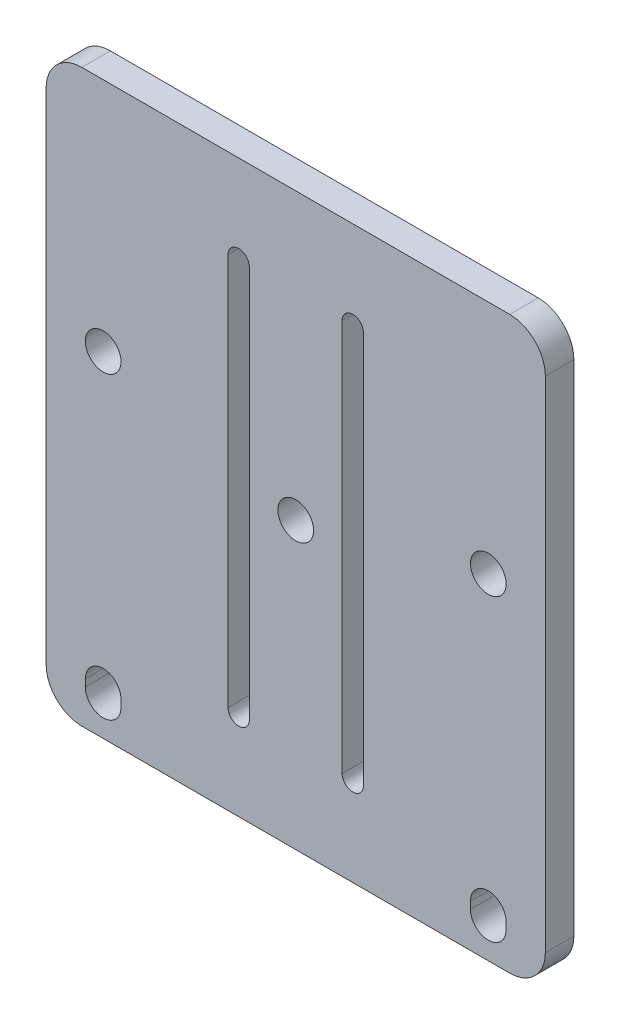
ISO-10303-21;
HEADER;
FILE_DESCRIPTION(('STEP AP214'),'2;1');
FILE_NAME('part.step','',(''),(''),'','','');
FILE_SCHEMA(('AUTOMOTIVE_DESIGN { 1 0 10303 214 1 1 1 1 }'));
ENDSEC;
DATA;
#1=APPLICATION_CONTEXT('core data for automotive mechanical design processes');
#2=APPLICATION_PROTOCOL_DEFINITION('international standard','automotive_design',2000,#1);
#3=PRODUCT_CONTEXT('',#1,'mechanical');
#4=PRODUCT('Part','Part','',(#3));
#5=PRODUCT_RELATED_PRODUCT_CATEGORY('part','',(#4));
#6=PRODUCT_DEFINITION_FORMATION('','',#4);
#7=PRODUCT_DEFINITION_CONTEXT('part definition',#1,'design');
#8=PRODUCT_DEFINITION('design','',#6,#7);
#9=PRODUCT_DEFINITION_SHAPE('','',#8);
#10=(LENGTH_UNIT() NAMED_UNIT(*) SI_UNIT(.MILLI.,.METRE.));
#11=(NAMED_UNIT(*) PLANE_ANGLE_UNIT() SI_UNIT($,.RADIAN.));
#12=(NAMED_UNIT(*) SI_UNIT($,.STERADIAN.) SOLID_ANGLE_UNIT());
#13=UNCERTAINTY_MEASURE_WITH_UNIT(LENGTH_MEASURE(1.E-05),#10,'distance_accuracy_value','');
#14=(GEOMETRIC_REPRESENTATION_CONTEXT(3) GLOBAL_UNCERTAINTY_ASSIGNED_CONTEXT((#13)) GLOBAL_UNIT_ASSIGNED_CONTEXT((#10,
#11,#12)) REPRESENTATION_CONTEXT('',''));
#15=CARTESIAN_POINT('',(0.,0.,0.));
#16=DIRECTION('',(0.,0.,1.));
#17=DIRECTION('',(1.,0.,0.));
#18=AXIS2_PLACEMENT_3D('',#15,#16,#17);
#19=CARTESIAN_POINT('',(0.,0.,4.));
#20=DIRECTION('',(0.,0.,1.));
#21=DIRECTION('',(1.,0.,0.));
#22=AXIS2_PLACEMENT_3D('',#19,#20,#21);
#23=PLANE('',#22);
#24=CARTESIAN_POINT('',(-8.,27.5,4.));
#25=DIRECTION('',(0.,0.,1.));
#26=DIRECTION('',(1.,0.,0.));
#27=AXIS2_PLACEMENT_3D('',#24,#25,#26);
#28=CIRCLE('',#27,1.50000000000001);
#29=CARTESIAN_POINT('',(-6.5,27.5,4.));
#30=VERTEX_POINT('',#29);
#31=CARTESIAN_POINT('',(-9.50000000000001,27.5,4.));
#32=VERTEX_POINT('',#31);
#33=EDGE_CURVE('E60',#30,#32,#28,.T.);
#34=ORIENTED_EDGE('',*,*,#33,.F.);
#35=DIRECTION('',(0.,1.,0.));
#36=VECTOR('',#35,1.);
#37=CARTESIAN_POINT('',(-6.5,27.5,4.));
#38=LINE('',#37,#36);
#39=CARTESIAN_POINT('',(-6.5,-27.5,4.));
#40=VERTEX_POINT('',#39);
#41=EDGE_CURVE('E228',#40,#30,#38,.T.);
#42=ORIENTED_EDGE('',*,*,#41,.F.);
#43=CARTESIAN_POINT('',(-8.,-27.5,4.));
#44=DIRECTION('',(0.,0.,1.));
#45=DIRECTION('',(1.,0.,0.));
#46=AXIS2_PLACEMENT_3D('',#43,#44,#45);
#47=CIRCLE('',#46,1.50000000000001);
#48=CARTESIAN_POINT('',(-9.50000000000001,-27.5,4.));
#49=VERTEX_POINT('',#48);
#50=EDGE_CURVE('E231',#49,#40,#47,.T.);
#51=ORIENTED_EDGE('',*,*,#50,.F.);
#52=DIRECTION('',(0.,-1.,0.));
#53=VECTOR('',#52,1.);
#54=CARTESIAN_POINT('',(-9.50000000000001,27.5,4.));
#55=LINE('',#54,#53);
#56=EDGE_CURVE('E239',#32,#49,#55,.T.);
#57=ORIENTED_EDGE('',*,*,#56,.F.);
#58=EDGE_LOOP('',(#34,#42,#51,#57));
#59=FACE_BOUND('',#58,.T.);
#60=CARTESIAN_POINT('',(7.99999999999999,27.5,4.));
#61=DIRECTION('',(0.,0.,1.));
#62=DIRECTION('',(-1.,0.,0.));
#63=AXIS2_PLACEMENT_3D('',#60,#61,#62);
#64=CIRCLE('',#63,1.50000000000001);
#65=CARTESIAN_POINT('',(9.50000000000002,27.5,4.));
#66=VERTEX_POINT('',#65);
#67=CARTESIAN_POINT('',(6.49999999999999,27.5,4.));
#68=VERTEX_POINT('',#67);
#69=EDGE_CURVE('E68',#66,#68,#64,.T.);
#70=ORIENTED_EDGE('',*,*,#69,.F.);
#71=DIRECTION('',(0.,1.,0.));
#72=VECTOR('',#71,1.);
#73=CARTESIAN_POINT('',(9.50000000000002,27.5,4.));
#74=LINE('',#73,#72);
#75=CARTESIAN_POINT('',(9.50000000000001,-27.5,4.));
#76=VERTEX_POINT('',#75);
#77=EDGE_CURVE('E261',#76,#66,#74,.T.);
#78=ORIENTED_EDGE('',*,*,#77,.F.);
#79=CARTESIAN_POINT('',(7.99999999999999,-27.5,4.));
#80=DIRECTION('',(0.,0.,1.));
#81=DIRECTION('',(-1.,0.,0.));
#82=AXIS2_PLACEMENT_3D('',#79,#80,#81);
#83=CIRCLE('',#82,1.50000000000001);
#84=CARTESIAN_POINT('',(6.49999999999999,-27.5,4.));
#85=VERTEX_POINT('',#84);
#86=EDGE_CURVE('E258',#85,#76,#83,.T.);
#87=ORIENTED_EDGE('',*,*,#86,.F.);
#88=DIRECTION('',(0.,-1.,0.));
#89=VECTOR('',#88,1.);
#90=CARTESIAN_POINT('',(6.49999999999999,27.5,4.));
#91=LINE('',#90,#89);
#92=EDGE_CURVE('E252',#68,#85,#91,.T.);
#93=ORIENTED_EDGE('',*,*,#92,.F.);
#94=EDGE_LOOP('',(#70,#78,#87,#93));
#95=FACE_BOUND('',#94,.T.);
#96=CARTESIAN_POINT('',(0.,0.,4.));
#97=DIRECTION('',(0.,0.,1.));
#98=DIRECTION('',(1.,0.,0.));
#99=AXIS2_PLACEMENT_3D('',#96,#97,#98);
#100=CIRCLE('',#99,2.5);
#101=CARTESIAN_POINT('',(2.5,0.,4.));
#102=VERTEX_POINT('',#101);
#103=EDGE_CURVE('E274',#102,#102,#100,.T.);
#104=ORIENTED_EDGE('',*,*,#103,.F.);
#105=EDGE_LOOP('',(#104));
#106=FACE_BOUND('',#105,.T.);
#107=DIRECTION('',(0.,-1.,0.));
#108=VECTOR('',#107,1.);
#109=CARTESIAN_POINT('',(24.5,-34.,4.));
#110=LINE('',#109,#108);
#111=CARTESIAN_POINT('',(24.5,-34.,4.));
#112=VERTEX_POINT('',#111);
#113=CARTESIAN_POINT('',(24.5,-35.,4.));
#114=VERTEX_POINT('',#113);
#115=EDGE_CURVE('E536',#112,#114,#110,.T.);
#116=ORIENTED_EDGE('',*,*,#115,.F.);
#117=CARTESIAN_POINT('',(27.,-34.,4.));
#118=DIRECTION('',(0.,0.,1.));
#119=DIRECTION('',(-1.,0.,0.));
#120=AXIS2_PLACEMENT_3D('',#117,#118,#119);
#121=CIRCLE('',#120,2.5);
#122=CARTESIAN_POINT('',(29.5,-34.,4.));
#123=VERTEX_POINT('',#122);
#124=EDGE_CURVE('E521',#123,#112,#121,.T.);
#125=ORIENTED_EDGE('',*,*,#124,.F.);
#126=DIRECTION('',(0.,1.,0.));
#127=VECTOR('',#126,1.);
#128=CARTESIAN_POINT('',(29.5,-34.,4.));
#129=LINE('',#128,#127);
#130=CARTESIAN_POINT('',(29.5,-35.,4.));
#131=VERTEX_POINT('',#130);
#132=EDGE_CURVE('E517',#131,#123,#129,.T.);
#133=ORIENTED_EDGE('',*,*,#132,.F.);
#134=CARTESIAN_POINT('',(27.,-35.,4.));
#135=DIRECTION('',(0.,0.,1.));
#136=DIRECTION('',(-1.,0.,0.));
#137=AXIS2_PLACEMENT_3D('',#134,#135,#136);
#138=CIRCLE('',#137,2.5);
#139=EDGE_CURVE('E531',#114,#131,#138,.T.);
#140=ORIENTED_EDGE('',*,*,#139,.F.);
#141=EDGE_LOOP('',(#116,#125,#133,#140));
#142=FACE_BOUND('',#141,.T.);
#143=DIRECTION('',(0.,-1.,0.));
#144=VECTOR('',#143,1.);
#145=CARTESIAN_POINT('',(-29.5,-34.,4.));
#146=LINE('',#145,#144);
#147=CARTESIAN_POINT('',(-29.5,-34.,4.));
#148=VERTEX_POINT('',#147);
#149=CARTESIAN_POINT('',(-29.5,-35.,4.));
#150=VERTEX_POINT('',#149);
#151=EDGE_CURVE('E291',#148,#150,#146,.T.);
#152=ORIENTED_EDGE('',*,*,#151,.F.);
#153=CARTESIAN_POINT('',(-27.,-34.,4.));
#154=DIRECTION('',(0.,0.,1.));
#155=DIRECTION('',(1.,0.,0.));
#156=AXIS2_PLACEMENT_3D('',#153,#154,#155);
#157=CIRCLE('',#156,2.5);
#158=CARTESIAN_POINT('',(-24.5,-34.,4.));
#159=VERTEX_POINT('',#158);
#160=EDGE_CURVE('E308',#159,#148,#157,.T.);
#161=ORIENTED_EDGE('',*,*,#160,.F.);
#162=DIRECTION('',(0.,1.,0.));
#163=VECTOR('',#162,1.);
#164=CARTESIAN_POINT('',(-24.5,-34.,4.));
#165=LINE('',#164,#163);
#166=CARTESIAN_POINT('',(-24.5,-35.,4.));
#167=VERTEX_POINT('',#166);
#168=EDGE_CURVE('E290',#167,#159,#165,.T.);
#169=ORIENTED_EDGE('',*,*,#168,.F.);
#170=CARTESIAN_POINT('',(-27.,-35.,4.));
#171=DIRECTION('',(0.,0.,1.));
#172=DIRECTION('',(1.,0.,0.));
#173=AXIS2_PLACEMENT_3D('',#170,#171,#172);
#174=CIRCLE('',#173,2.5);
#175=EDGE_CURVE('E284',#150,#167,#174,.T.);
#176=ORIENTED_EDGE('',*,*,#175,.F.);
#177=EDGE_LOOP('',(#152,#161,#169,#176));
#178=FACE_BOUND('',#177,.T.);
#179=CARTESIAN_POINT('',(-27.,7.,4.));
#180=DIRECTION('',(0.,0.,1.));
#181=DIRECTION('',(1.,0.,0.));
#182=AXIS2_PLACEMENT_3D('',#179,#180,#181);
#183=CIRCLE('',#182,2.5);
#184=CARTESIAN_POINT('',(-24.5,7.,4.));
#185=VERTEX_POINT('',#184);
#186=EDGE_CURVE('E318',#185,#185,#183,.T.);
#187=ORIENTED_EDGE('',*,*,#186,.F.);
#188=EDGE_LOOP('',(#187));
#189=FACE_BOUND('',#188,.T.);
#190=DIRECTION('',(0.,-1.,0.));
#191=VECTOR('',#190,1.);
#192=CARTESIAN_POINT('',(-35.,40.,4.));
#193=LINE('',#192,#191);
#194=CARTESIAN_POINT('',(-35.,35.,4.));
#195=VERTEX_POINT('',#194);
#196=CARTESIAN_POINT('',(-35.,-35.,4.));
#197=VERTEX_POINT('',#196);
#198=EDGE_CURVE('E333',#195,#197,#193,.T.);
#199=ORIENTED_EDGE('',*,*,#198,.T.);
#200=CARTESIAN_POINT('',(-30.,-35.,4.));
#201=DIRECTION('',(0.,0.,1.));
#202=DIRECTION('',(1.,0.,0.));
#203=AXIS2_PLACEMENT_3D('',#200,#201,#202);
#204=CIRCLE('',#203,5.);
#205=CARTESIAN_POINT('',(-30.,-40.,4.));
#206=VERTEX_POINT('',#205);
#207=EDGE_CURVE('E374',#197,#206,#204,.T.);
#208=ORIENTED_EDGE('',*,*,#207,.T.);
#209=DIRECTION('',(1.,0.,0.));
#210=VECTOR('',#209,1.);
#211=CARTESIAN_POINT('',(-35.,-40.,4.));
#212=LINE('',#211,#210);
#213=CARTESIAN_POINT('',(30.,-40.,4.));
#214=VERTEX_POINT('',#213);
#215=EDGE_CURVE('E337',#206,#214,#212,.T.);
#216=ORIENTED_EDGE('',*,*,#215,.T.);
#217=CARTESIAN_POINT('',(30.,-35.,4.));
#218=DIRECTION('',(0.,0.,1.));
#219=DIRECTION('',(1.,0.,0.));
#220=AXIS2_PLACEMENT_3D('',#217,#218,#219);
#221=CIRCLE('',#220,5.);
#222=CARTESIAN_POINT('',(35.,-35.,4.));
#223=VERTEX_POINT('',#222);
#224=EDGE_CURVE('E372',#214,#223,#221,.T.);
#225=ORIENTED_EDGE('',*,*,#224,.T.);
#226=DIRECTION('',(0.,1.,0.));
#227=VECTOR('',#226,1.);
#228=CARTESIAN_POINT('',(35.,40.,4.));
#229=LINE('',#228,#227);
#230=CARTESIAN_POINT('',(35.,35.,4.));
#231=VERTEX_POINT('',#230);
#232=EDGE_CURVE('E326',#223,#231,#229,.T.);
#233=ORIENTED_EDGE('',*,*,#232,.T.);
#234=CARTESIAN_POINT('',(30.,35.,4.));
#235=DIRECTION('',(0.,0.,1.));
#236=DIRECTION('',(1.,0.,0.));
#237=AXIS2_PLACEMENT_3D('',#234,#235,#236);
#238=CIRCLE('',#237,5.);
#239=CARTESIAN_POINT('',(30.,40.,4.));
#240=VERTEX_POINT('',#239);
#241=EDGE_CURVE('E370',#231,#240,#238,.T.);
#242=ORIENTED_EDGE('',*,*,#241,.T.);
#243=DIRECTION('',(-1.,0.,0.));
#244=VECTOR('',#243,1.);
#245=CARTESIAN_POINT('',(-35.,40.,4.));
#246=LINE('',#245,#244);
#247=CARTESIAN_POINT('',(-30.,40.,4.));
#248=VERTEX_POINT('',#247);
#249=EDGE_CURVE('E329',#240,#248,#246,.T.);
#250=ORIENTED_EDGE('',*,*,#249,.T.);
#251=CARTESIAN_POINT('',(-30.,35.,4.));
#252=DIRECTION('',(0.,0.,1.));
#253=DIRECTION('',(1.,0.,0.));
#254=AXIS2_PLACEMENT_3D('',#251,#252,#253);
#255=CIRCLE('',#254,5.);
#256=EDGE_CURVE('E368',#248,#195,#255,.T.);
#257=ORIENTED_EDGE('',*,*,#256,.T.);
#258=EDGE_LOOP('',(#199,#208,#216,#225,#233,#242,#250,#257));
#259=FACE_BOUND('',#258,.T.);
#260=CARTESIAN_POINT('',(27.,7.,4.));
#261=DIRECTION('',(0.,0.,1.));
#262=DIRECTION('',(-1.,0.,0.));
#263=AXIS2_PLACEMENT_3D('',#260,#261,#262);
#264=CIRCLE('',#263,2.5);
#265=CARTESIAN_POINT('',(24.5,7.,4.));
#266=VERTEX_POINT('',#265);
#267=EDGE_CURVE('E279',#266,#266,#264,.T.);
#268=ORIENTED_EDGE('',*,*,#267,.F.);
#269=EDGE_LOOP('',(#268));
#270=FACE_BOUND('',#269,.T.);
#271=ADVANCED_FACE('F45',(#59,#95,#106,#142,#178,#189,#259,#270),#23,.T.);
#272=CARTESIAN_POINT('',(0.,0.,0.));
#273=DIRECTION('',(0.,0.,1.));
#274=DIRECTION('',(1.,0.,0.));
#275=AXIS2_PLACEMENT_3D('',#272,#273,#274);
#276=PLANE('',#275);
#277=DIRECTION('',(0.,1.,0.));
#278=VECTOR('',#277,1.);
#279=CARTESIAN_POINT('',(-6.5,27.5,0.));
#280=LINE('',#279,#278);
#281=CARTESIAN_POINT('',(-6.5,-27.5,0.));
#282=VERTEX_POINT('',#281);
#283=CARTESIAN_POINT('',(-6.5,27.5,0.));
#284=VERTEX_POINT('',#283);
#285=EDGE_CURVE('E214',#282,#284,#280,.T.);
#286=ORIENTED_EDGE('',*,*,#285,.T.);
#287=CARTESIAN_POINT('',(-8.,27.5,0.));
#288=DIRECTION('',(0.,0.,1.));
#289=DIRECTION('',(1.,0.,0.));
#290=AXIS2_PLACEMENT_3D('',#287,#288,#289);
#291=CIRCLE('',#290,1.50000000000001);
#292=CARTESIAN_POINT('',(-9.50000000000001,27.5,0.));
#293=VERTEX_POINT('',#292);
#294=EDGE_CURVE('E208',#284,#293,#291,.T.);
#295=ORIENTED_EDGE('',*,*,#294,.T.);
#296=DIRECTION('',(0.,-1.,0.));
#297=VECTOR('',#296,1.);
#298=CARTESIAN_POINT('',(-9.50000000000001,27.5,0.));
#299=LINE('',#298,#297);
#300=CARTESIAN_POINT('',(-9.50000000000001,-27.5,0.));
#301=VERTEX_POINT('',#300);
#302=EDGE_CURVE('E218',#293,#301,#299,.T.);
#303=ORIENTED_EDGE('',*,*,#302,.T.);
#304=CARTESIAN_POINT('',(-8.,-27.5,0.));
#305=DIRECTION('',(0.,0.,1.));
#306=DIRECTION('',(1.,0.,0.));
#307=AXIS2_PLACEMENT_3D('',#304,#305,#306);
#308=CIRCLE('',#307,1.50000000000001);
#309=EDGE_CURVE('E222',#301,#282,#308,.T.);
#310=ORIENTED_EDGE('',*,*,#309,.T.);
#311=EDGE_LOOP('',(#286,#295,#303,#310));
#312=FACE_BOUND('',#311,.T.);
#313=DIRECTION('',(0.,1.,0.));
#314=VECTOR('',#313,1.);
#315=CARTESIAN_POINT('',(9.50000000000002,27.5,0.));
#316=LINE('',#315,#314);
#317=CARTESIAN_POINT('',(9.50000000000001,-27.5,0.));
#318=VERTEX_POINT('',#317);
#319=CARTESIAN_POINT('',(9.50000000000002,27.5,0.));
#320=VERTEX_POINT('',#319);
#321=EDGE_CURVE('E254',#318,#320,#316,.T.);
#322=ORIENTED_EDGE('',*,*,#321,.T.);
#323=CARTESIAN_POINT('',(7.99999999999999,27.5,0.));
#324=DIRECTION('',(0.,0.,1.));
#325=DIRECTION('',(-1.,0.,0.));
#326=AXIS2_PLACEMENT_3D('',#323,#324,#325);
#327=CIRCLE('',#326,1.50000000000001);
#328=CARTESIAN_POINT('',(6.49999999999999,27.5,0.));
#329=VERTEX_POINT('',#328);
#330=EDGE_CURVE('E264',#320,#329,#327,.T.);
#331=ORIENTED_EDGE('',*,*,#330,.T.);
#332=DIRECTION('',(0.,-1.,0.));
#333=VECTOR('',#332,1.);
#334=CARTESIAN_POINT('',(6.49999999999999,27.5,0.));
#335=LINE('',#334,#333);
#336=CARTESIAN_POINT('',(6.49999999999999,-27.5,0.));
#337=VERTEX_POINT('',#336);
#338=EDGE_CURVE('E551',#329,#337,#335,.T.);
#339=ORIENTED_EDGE('',*,*,#338,.T.);
#340=CARTESIAN_POINT('',(7.99999999999999,-27.5,0.));
#341=DIRECTION('',(0.,0.,1.));
#342=DIRECTION('',(-1.,0.,0.));
#343=AXIS2_PLACEMENT_3D('',#340,#341,#342);
#344=CIRCLE('',#343,1.50000000000001);
#345=EDGE_CURVE('E553',#337,#318,#344,.T.);
#346=ORIENTED_EDGE('',*,*,#345,.T.);
#347=EDGE_LOOP('',(#322,#331,#339,#346));
#348=FACE_BOUND('',#347,.T.);
#349=CARTESIAN_POINT('',(0.,0.,0.));
#350=DIRECTION('',(0.,0.,1.));
#351=DIRECTION('',(1.,0.,0.));
#352=AXIS2_PLACEMENT_3D('',#349,#350,#351);
#353=CIRCLE('',#352,2.5);
#354=CARTESIAN_POINT('',(2.5,0.,0.));
#355=VERTEX_POINT('',#354);
#356=EDGE_CURVE('E253',#355,#355,#353,.T.);
#357=ORIENTED_EDGE('',*,*,#356,.T.);
#358=EDGE_LOOP('',(#357));
#359=FACE_BOUND('',#358,.T.);
#360=CARTESIAN_POINT('',(-27.,-34.,0.));
#361=DIRECTION('',(0.,0.,1.));
#362=DIRECTION('',(1.,0.,0.));
#363=AXIS2_PLACEMENT_3D('',#360,#361,#362);
#364=CIRCLE('',#363,2.5);
#365=CARTESIAN_POINT('',(-24.5,-34.,0.));
#366=VERTEX_POINT('',#365);
#367=CARTESIAN_POINT('',(-29.5,-34.,0.));
#368=VERTEX_POINT('',#367);
#369=EDGE_CURVE('E295',#366,#368,#364,.T.);
#370=ORIENTED_EDGE('',*,*,#369,.T.);
#371=DIRECTION('',(0.,-1.,0.));
#372=VECTOR('',#371,1.);
#373=CARTESIAN_POINT('',(-29.5,-34.,0.));
#374=LINE('',#373,#372);
#375=CARTESIAN_POINT('',(-29.5,-35.,0.));
#376=VERTEX_POINT('',#375);
#377=EDGE_CURVE('E298',#368,#376,#374,.T.);
#378=ORIENTED_EDGE('',*,*,#377,.T.);
#379=CARTESIAN_POINT('',(-27.,-35.,0.));
#380=DIRECTION('',(0.,0.,1.));
#381=DIRECTION('',(1.,0.,0.));
#382=AXIS2_PLACEMENT_3D('',#379,#380,#381);
#383=CIRCLE('',#382,2.5);
#384=CARTESIAN_POINT('',(-24.5,-35.,0.));
#385=VERTEX_POINT('',#384);
#386=EDGE_CURVE('E302',#376,#385,#383,.T.);
#387=ORIENTED_EDGE('',*,*,#386,.T.);
#388=DIRECTION('',(0.,1.,0.));
#389=VECTOR('',#388,1.);
#390=CARTESIAN_POINT('',(-24.5,-34.,0.));
#391=LINE('',#390,#389);
#392=EDGE_CURVE('E305',#385,#366,#391,.T.);
#393=ORIENTED_EDGE('',*,*,#392,.T.);
#394=EDGE_LOOP('',(#370,#378,#387,#393));
#395=FACE_BOUND('',#394,.T.);
#396=DIRECTION('',(1.,0.,0.));
#397=VECTOR('',#396,1.);
#398=CARTESIAN_POINT('',(-35.,-40.,0.));
#399=LINE('',#398,#397);
#400=CARTESIAN_POINT('',(-30.,-40.,0.));
#401=VERTEX_POINT('',#400);
#402=CARTESIAN_POINT('',(30.,-40.,0.));
#403=VERTEX_POINT('',#402);
#404=EDGE_CURVE('E330',#401,#403,#399,.T.);
#405=ORIENTED_EDGE('',*,*,#404,.F.);
#406=CARTESIAN_POINT('',(-30.,-35.,0.));
#407=DIRECTION('',(0.,0.,1.));
#408=DIRECTION('',(1.,0.,0.));
#409=AXIS2_PLACEMENT_3D('',#406,#407,#408);
#410=CIRCLE('',#409,5.);
#411=CARTESIAN_POINT('',(-35.,-35.,0.));
#412=VERTEX_POINT('',#411);
#413=EDGE_CURVE('E361',#401,#412,#410,.F.);
#414=ORIENTED_EDGE('',*,*,#413,.T.);
#415=DIRECTION('',(0.,-1.,0.));
#416=VECTOR('',#415,1.);
#417=CARTESIAN_POINT('',(-35.,40.,0.));
#418=LINE('',#417,#416);
#419=CARTESIAN_POINT('',(-35.,35.,0.));
#420=VERTEX_POINT('',#419);
#421=EDGE_CURVE('E346',#420,#412,#418,.T.);
#422=ORIENTED_EDGE('',*,*,#421,.F.);
#423=CARTESIAN_POINT('',(-30.,35.,0.));
#424=DIRECTION('',(0.,0.,1.));
#425=DIRECTION('',(1.,0.,0.));
#426=AXIS2_PLACEMENT_3D('',#423,#424,#425);
#427=CIRCLE('',#426,5.);
#428=CARTESIAN_POINT('',(-30.,40.,0.));
#429=VERTEX_POINT('',#428);
#430=EDGE_CURVE('E355',#420,#429,#427,.F.);
#431=ORIENTED_EDGE('',*,*,#430,.T.);
#432=DIRECTION('',(-1.,0.,0.));
#433=VECTOR('',#432,1.);
#434=CARTESIAN_POINT('',(-35.,40.,0.));
#435=LINE('',#434,#433);
#436=CARTESIAN_POINT('',(30.,40.,0.));
#437=VERTEX_POINT('',#436);
#438=EDGE_CURVE('E343',#437,#429,#435,.T.);
#439=ORIENTED_EDGE('',*,*,#438,.F.);
#440=CARTESIAN_POINT('',(30.,35.,0.));
#441=DIRECTION('',(0.,0.,1.));
#442=DIRECTION('',(1.,0.,0.));
#443=AXIS2_PLACEMENT_3D('',#440,#441,#442);
#444=CIRCLE('',#443,5.);
#445=CARTESIAN_POINT('',(35.,35.,0.));
#446=VERTEX_POINT('',#445);
#447=EDGE_CURVE('E357',#437,#446,#444,.F.);
#448=ORIENTED_EDGE('',*,*,#447,.T.);
#449=DIRECTION('',(0.,1.,0.));
#450=VECTOR('',#449,1.);
#451=CARTESIAN_POINT('',(35.,40.,0.));
#452=LINE('',#451,#450);
#453=CARTESIAN_POINT('',(35.,-35.,0.));
#454=VERTEX_POINT('',#453);
#455=EDGE_CURVE('E323',#454,#446,#452,.T.);
#456=ORIENTED_EDGE('',*,*,#455,.F.);
#457=CARTESIAN_POINT('',(30.,-35.,0.));
#458=DIRECTION('',(0.,0.,1.));
#459=DIRECTION('',(1.,0.,0.));
#460=AXIS2_PLACEMENT_3D('',#457,#458,#459);
#461=CIRCLE('',#460,5.);
#462=EDGE_CURVE('E359',#454,#403,#461,.F.);
#463=ORIENTED_EDGE('',*,*,#462,.T.);
#464=EDGE_LOOP('',(#405,#414,#422,#431,#439,#448,#456,#463));
#465=FACE_BOUND('',#464,.T.);
#466=CARTESIAN_POINT('',(-27.,7.,0.));
#467=DIRECTION('',(0.,0.,1.));
#468=DIRECTION('',(1.,0.,0.));
#469=AXIS2_PLACEMENT_3D('',#466,#467,#468);
#470=CIRCLE('',#469,2.5);
#471=CARTESIAN_POINT('',(-24.5,7.,0.));
#472=VERTEX_POINT('',#471);
#473=EDGE_CURVE('E317',#472,#472,#470,.T.);
#474=ORIENTED_EDGE('',*,*,#473,.T.);
#475=EDGE_LOOP('',(#474));
#476=FACE_BOUND('',#475,.T.);
#477=CARTESIAN_POINT('',(27.,-34.,0.));
#478=DIRECTION('',(0.,0.,1.));
#479=DIRECTION('',(-1.,0.,0.));
#480=AXIS2_PLACEMENT_3D('',#477,#478,#479);
#481=CIRCLE('',#480,2.5);
#482=CARTESIAN_POINT('',(29.5,-34.,0.));
#483=VERTEX_POINT('',#482);
#484=CARTESIAN_POINT('',(24.5,-34.,0.));
#485=VERTEX_POINT('',#484);
#486=EDGE_CURVE('E528',#483,#485,#481,.T.);
#487=ORIENTED_EDGE('',*,*,#486,.T.);
#488=DIRECTION('',(0.,-1.,0.));
#489=VECTOR('',#488,1.);
#490=CARTESIAN_POINT('',(24.5,-34.,0.));
#491=LINE('',#490,#489);
#492=CARTESIAN_POINT('',(24.5,-35.,0.));
#493=VERTEX_POINT('',#492);
#494=EDGE_CURVE('E525',#485,#493,#491,.T.);
#495=ORIENTED_EDGE('',*,*,#494,.T.);
#496=CARTESIAN_POINT('',(27.,-35.,0.));
#497=DIRECTION('',(0.,0.,1.));
#498=DIRECTION('',(-1.,0.,0.));
#499=AXIS2_PLACEMENT_3D('',#496,#497,#498);
#500=CIRCLE('',#499,2.5);
#501=CARTESIAN_POINT('',(29.5,-35.,0.));
#502=VERTEX_POINT('',#501);
#503=EDGE_CURVE('E522',#493,#502,#500,.T.);
#504=ORIENTED_EDGE('',*,*,#503,.T.);
#505=DIRECTION('',(0.,1.,0.));
#506=VECTOR('',#505,1.);
#507=CARTESIAN_POINT('',(29.5,-34.,0.));
#508=LINE('',#507,#506);
#509=EDGE_CURVE('E518',#502,#483,#508,.T.);
#510=ORIENTED_EDGE('',*,*,#509,.T.);
#511=EDGE_LOOP('',(#487,#495,#504,#510));
#512=FACE_BOUND('',#511,.T.);
#513=CARTESIAN_POINT('',(27.,7.,0.));
#514=DIRECTION('',(0.,0.,1.));
#515=DIRECTION('',(-1.,0.,0.));
#516=AXIS2_PLACEMENT_3D('',#513,#514,#515);
#517=CIRCLE('',#516,2.5);
#518=CARTESIAN_POINT('',(24.5,7.,0.));
#519=VERTEX_POINT('',#518);
#520=EDGE_CURVE('E538',#519,#519,#517,.T.);
#521=ORIENTED_EDGE('',*,*,#520,.T.);
#522=EDGE_LOOP('',(#521));
#523=FACE_BOUND('',#522,.T.);
#524=ADVANCED_FACE('F225',(#312,#348,#359,#395,#465,#476,#512,#523),#276,.F.);
#525=CARTESIAN_POINT('',(35.,40.,4.));
#526=DIRECTION('',(-1.,0.,0.));
#527=DIRECTION('',(0.,-1.,0.));
#528=AXIS2_PLACEMENT_3D('',#525,#526,#527);
#529=PLANE('',#528);
#530=ORIENTED_EDGE('',*,*,#232,.F.);
#531=DIRECTION('',(0.,0.,-1.));
#532=VECTOR('',#531,1.);
#533=CARTESIAN_POINT('',(35.,-35.,4.));
#534=LINE('',#533,#532);
#535=EDGE_CURVE('E378',#223,#454,#534,.T.);
#536=ORIENTED_EDGE('',*,*,#535,.T.);
#537=ORIENTED_EDGE('',*,*,#455,.T.);
#538=DIRECTION('',(0.,0.,-1.));
#539=VECTOR('',#538,1.);
#540=CARTESIAN_POINT('',(35.,35.,4.));
#541=LINE('',#540,#539);
#542=EDGE_CURVE('E376',#446,#231,#541,.F.);
#543=ORIENTED_EDGE('',*,*,#542,.T.);
#544=EDGE_LOOP('',(#530,#536,#537,#543));
#545=FACE_BOUND('',#544,.T.);
#546=ADVANCED_FACE('F415',(#545),#529,.F.);
#547=CARTESIAN_POINT('',(-35.,40.,4.));
#548=DIRECTION('',(0.,-1.,0.));
#549=DIRECTION('',(0.,0.,-1.));
#550=AXIS2_PLACEMENT_3D('',#547,#548,#549);
#551=PLANE('',#550);
#552=ORIENTED_EDGE('',*,*,#249,.F.);
#553=DIRECTION('',(0.,0.,-1.));
#554=VECTOR('',#553,1.);
#555=CARTESIAN_POINT('',(30.,40.,4.));
#556=LINE('',#555,#554);
#557=EDGE_CURVE('E12',#240,#437,#556,.T.);
#558=ORIENTED_EDGE('',*,*,#557,.T.);
#559=ORIENTED_EDGE('',*,*,#438,.T.);
#560=DIRECTION('',(0.,0.,-1.));
#561=VECTOR('',#560,1.);
#562=CARTESIAN_POINT('',(-30.,40.,4.));
#563=LINE('',#562,#561);
#564=EDGE_CURVE('E53',#429,#248,#563,.F.);
#565=ORIENTED_EDGE('',*,*,#564,.T.);
#566=EDGE_LOOP('',(#552,#558,#559,#565));
#567=FACE_BOUND('',#566,.T.);
#568=ADVANCED_FACE('F383',(#567),#551,.F.);
#569=CARTESIAN_POINT('',(-35.,40.,4.));
#570=DIRECTION('',(1.,0.,0.));
#571=DIRECTION('',(0.,0.,-1.));
#572=AXIS2_PLACEMENT_3D('',#569,#570,#571);
#573=PLANE('',#572);
#574=ORIENTED_EDGE('',*,*,#421,.T.);
#575=DIRECTION('',(0.,0.,-1.));
#576=VECTOR('',#575,1.);
#577=CARTESIAN_POINT('',(-35.,-35.,4.));
#578=LINE('',#577,#576);
#579=EDGE_CURVE('E366',#412,#197,#578,.F.);
#580=ORIENTED_EDGE('',*,*,#579,.T.);
#581=ORIENTED_EDGE('',*,*,#198,.F.);
#582=DIRECTION('',(0.,0.,-1.));
#583=VECTOR('',#582,1.);
#584=CARTESIAN_POINT('',(-35.,35.,4.));
#585=LINE('',#584,#583);
#586=EDGE_CURVE('E363',#195,#420,#585,.T.);
#587=ORIENTED_EDGE('',*,*,#586,.T.);
#588=EDGE_LOOP('',(#574,#580,#581,#587));
#589=FACE_BOUND('',#588,.T.);
#590=ADVANCED_FACE('F395',(#589),#573,.F.);
#591=CARTESIAN_POINT('',(-35.,-40.,4.));
#592=DIRECTION('',(0.,1.,0.));
#593=DIRECTION('',(0.,0.,1.));
#594=AXIS2_PLACEMENT_3D('',#591,#592,#593);
#595=PLANE('',#594);
#596=ORIENTED_EDGE('',*,*,#215,.F.);
#597=DIRECTION('',(0.,0.,-1.));
#598=VECTOR('',#597,1.);
#599=CARTESIAN_POINT('',(-30.,-40.,4.));
#600=LINE('',#599,#598);
#601=EDGE_CURVE('E352',#206,#401,#600,.T.);
#602=ORIENTED_EDGE('',*,*,#601,.T.);
#603=ORIENTED_EDGE('',*,*,#404,.T.);
#604=DIRECTION('',(0.,0.,-1.));
#605=VECTOR('',#604,1.);
#606=CARTESIAN_POINT('',(30.,-40.,4.));
#607=LINE('',#606,#605);
#608=EDGE_CURVE('E340',#403,#214,#607,.F.);
#609=ORIENTED_EDGE('',*,*,#608,.T.);
#610=EDGE_LOOP('',(#596,#602,#603,#609));
#611=FACE_BOUND('',#610,.T.);
#612=ADVANCED_FACE('F406',(#611),#595,.F.);
#613=CARTESIAN_POINT('',(-27.,7.,4.));
#614=DIRECTION('',(0.,0.,-1.));
#615=DIRECTION('',(-1.,0.,0.));
#616=AXIS2_PLACEMENT_3D('',#613,#614,#615);
#617=CYLINDRICAL_SURFACE('',#616,2.5);
#618=ORIENTED_EDGE('',*,*,#186,.T.);
#619=EDGE_LOOP('',(#618));
#620=FACE_BOUND('',#619,.T.);
#621=ORIENTED_EDGE('',*,*,#473,.F.);
#622=EDGE_LOOP('',(#621));
#623=FACE_BOUND('',#622,.T.);
#624=ADVANCED_FACE('F436',(#620,#623),#617,.F.);
#625=CARTESIAN_POINT('',(-27.,-34.,4.));
#626=DIRECTION('',(0.,0.,-1.));
#627=DIRECTION('',(-1.,0.,0.));
#628=AXIS2_PLACEMENT_3D('',#625,#626,#627);
#629=CYLINDRICAL_SURFACE('',#628,2.5);
#630=ORIENTED_EDGE('',*,*,#369,.F.);
#631=DIRECTION('',(0.,0.,-1.));
#632=VECTOR('',#631,1.);
#633=CARTESIAN_POINT('',(-24.5,-34.,4.));
#634=LINE('',#633,#632);
#635=EDGE_CURVE('E294',#159,#366,#634,.T.);
#636=ORIENTED_EDGE('',*,*,#635,.F.);
#637=ORIENTED_EDGE('',*,*,#160,.T.);
#638=DIRECTION('',(0.,0.,-1.));
#639=VECTOR('',#638,1.);
#640=CARTESIAN_POINT('',(-29.5,-34.,4.));
#641=LINE('',#640,#639);
#642=EDGE_CURVE('E315',#148,#368,#641,.T.);
#643=ORIENTED_EDGE('',*,*,#642,.T.);
#644=EDGE_LOOP('',(#630,#636,#637,#643));
#645=FACE_BOUND('',#644,.T.);
#646=ADVANCED_FACE('F487',(#645),#629,.F.);
#647=CARTESIAN_POINT('',(-29.5,-34.,4.));
#648=DIRECTION('',(1.,0.,0.));
#649=DIRECTION('',(0.,0.,-1.));
#650=AXIS2_PLACEMENT_3D('',#647,#648,#649);
#651=PLANE('',#650);
#652=ORIENTED_EDGE('',*,*,#377,.F.);
#653=ORIENTED_EDGE('',*,*,#642,.F.);
#654=ORIENTED_EDGE('',*,*,#151,.T.);
#655=DIRECTION('',(0.,0.,-1.));
#656=VECTOR('',#655,1.);
#657=CARTESIAN_POINT('',(-29.5,-35.,4.));
#658=LINE('',#657,#656);
#659=EDGE_CURVE('E313',#150,#376,#658,.T.);
#660=ORIENTED_EDGE('',*,*,#659,.T.);
#661=EDGE_LOOP('',(#652,#653,#654,#660));
#662=FACE_BOUND('',#661,.T.);
#663=ADVANCED_FACE('F484',(#662),#651,.T.);
#664=CARTESIAN_POINT('',(-27.,-35.,4.));
#665=DIRECTION('',(0.,0.,-1.));
#666=DIRECTION('',(-1.,0.,0.));
#667=AXIS2_PLACEMENT_3D('',#664,#665,#666);
#668=CYLINDRICAL_SURFACE('',#667,2.5);
#669=ORIENTED_EDGE('',*,*,#386,.F.);
#670=ORIENTED_EDGE('',*,*,#659,.F.);
#671=ORIENTED_EDGE('',*,*,#175,.T.);
#672=DIRECTION('',(0.,0.,-1.));
#673=VECTOR('',#672,1.);
#674=CARTESIAN_POINT('',(-24.5,-35.,4.));
#675=LINE('',#674,#673);
#676=EDGE_CURVE('E311',#167,#385,#675,.T.);
#677=ORIENTED_EDGE('',*,*,#676,.T.);
#678=EDGE_LOOP('',(#669,#670,#671,#677));
#679=FACE_BOUND('',#678,.T.);
#680=ADVANCED_FACE('F480',(#679),#668,.F.);
#681=CARTESIAN_POINT('',(-24.5,-34.,4.));
#682=DIRECTION('',(-1.,0.,0.));
#683=DIRECTION('',(0.,0.,1.));
#684=AXIS2_PLACEMENT_3D('',#681,#682,#683);
#685=PLANE('',#684);
#686=ORIENTED_EDGE('',*,*,#392,.F.);
#687=ORIENTED_EDGE('',*,*,#676,.F.);
#688=ORIENTED_EDGE('',*,*,#168,.T.);
#689=ORIENTED_EDGE('',*,*,#635,.T.);
#690=EDGE_LOOP('',(#686,#687,#688,#689));
#691=FACE_BOUND('',#690,.T.);
#692=ADVANCED_FACE('F476',(#691),#685,.T.);
#693=CARTESIAN_POINT('',(27.,-34.,4.));
#694=DIRECTION('',(0.,0.,-1.));
#695=DIRECTION('',(-1.,0.,0.));
#696=AXIS2_PLACEMENT_3D('',#693,#694,#695);
#697=CYLINDRICAL_SURFACE('',#696,2.5);
#698=ORIENTED_EDGE('',*,*,#486,.F.);
#699=DIRECTION('',(0.,0.,-1.));
#700=VECTOR('',#699,1.);
#701=CARTESIAN_POINT('',(29.5,-34.,4.));
#702=LINE('',#701,#700);
#703=EDGE_CURVE('E514',#123,#483,#702,.T.);
#704=ORIENTED_EDGE('',*,*,#703,.F.);
#705=ORIENTED_EDGE('',*,*,#124,.T.);
#706=DIRECTION('',(0.,0.,-1.));
#707=VECTOR('',#706,1.);
#708=CARTESIAN_POINT('',(24.5,-34.,4.));
#709=LINE('',#708,#707);
#710=EDGE_CURVE('E299',#112,#485,#709,.T.);
#711=ORIENTED_EDGE('',*,*,#710,.T.);
#712=EDGE_LOOP('',(#698,#704,#705,#711));
#713=FACE_BOUND('',#712,.T.);
#714=ADVANCED_FACE('F472',(#713),#697,.F.);
#715=CARTESIAN_POINT('',(24.5,-34.,4.));
#716=DIRECTION('',(1.,0.,0.));
#717=DIRECTION('',(0.,0.,-1.));
#718=AXIS2_PLACEMENT_3D('',#715,#716,#717);
#719=PLANE('',#718);
#720=ORIENTED_EDGE('',*,*,#494,.F.);
#721=ORIENTED_EDGE('',*,*,#710,.F.);
#722=ORIENTED_EDGE('',*,*,#115,.T.);
#723=DIRECTION('',(0.,0.,-1.));
#724=VECTOR('',#723,1.);
#725=CARTESIAN_POINT('',(24.5,-35.,4.));
#726=LINE('',#725,#724);
#727=EDGE_CURVE('E510',#114,#493,#726,.T.);
#728=ORIENTED_EDGE('',*,*,#727,.T.);
#729=EDGE_LOOP('',(#720,#721,#722,#728));
#730=FACE_BOUND('',#729,.T.);
#731=ADVANCED_FACE('F468',(#730),#719,.T.);
#732=CARTESIAN_POINT('',(27.,-35.,4.));
#733=DIRECTION('',(0.,0.,-1.));
#734=DIRECTION('',(-1.,0.,0.));
#735=AXIS2_PLACEMENT_3D('',#732,#733,#734);
#736=CYLINDRICAL_SURFACE('',#735,2.5);
#737=ORIENTED_EDGE('',*,*,#503,.F.);
#738=ORIENTED_EDGE('',*,*,#727,.F.);
#739=ORIENTED_EDGE('',*,*,#139,.T.);
#740=DIRECTION('',(0.,0.,-1.));
#741=VECTOR('',#740,1.);
#742=CARTESIAN_POINT('',(29.5,-35.,4.));
#743=LINE('',#742,#741);
#744=EDGE_CURVE('E512',#131,#502,#743,.T.);
#745=ORIENTED_EDGE('',*,*,#744,.T.);
#746=EDGE_LOOP('',(#737,#738,#739,#745));
#747=FACE_BOUND('',#746,.T.);
#748=ADVANCED_FACE('F458',(#747),#736,.F.);
#749=CARTESIAN_POINT('',(29.5,-34.,4.));
#750=DIRECTION('',(-1.,0.,0.));
#751=DIRECTION('',(0.,0.,1.));
#752=AXIS2_PLACEMENT_3D('',#749,#750,#751);
#753=PLANE('',#752);
#754=ORIENTED_EDGE('',*,*,#509,.F.);
#755=ORIENTED_EDGE('',*,*,#744,.F.);
#756=ORIENTED_EDGE('',*,*,#132,.T.);
#757=ORIENTED_EDGE('',*,*,#703,.T.);
#758=EDGE_LOOP('',(#754,#755,#756,#757));
#759=FACE_BOUND('',#758,.T.);
#760=ADVANCED_FACE('F452',(#759),#753,.T.);
#761=CARTESIAN_POINT('',(27.,7.,4.));
#762=DIRECTION('',(0.,0.,-1.));
#763=DIRECTION('',(-1.,0.,0.));
#764=AXIS2_PLACEMENT_3D('',#761,#762,#763);
#765=CYLINDRICAL_SURFACE('',#764,2.5);
#766=ORIENTED_EDGE('',*,*,#267,.T.);
#767=EDGE_LOOP('',(#766));
#768=FACE_BOUND('',#767,.T.);
#769=ORIENTED_EDGE('',*,*,#520,.F.);
#770=EDGE_LOOP('',(#769));
#771=FACE_BOUND('',#770,.T.);
#772=ADVANCED_FACE('F448',(#768,#771),#765,.F.);
#773=CARTESIAN_POINT('',(-30.,-35.,4.));
#774=DIRECTION('',(0.,0.,-1.));
#775=DIRECTION('',(-1.,0.,0.));
#776=AXIS2_PLACEMENT_3D('',#773,#774,#775);
#777=CYLINDRICAL_SURFACE('',#776,5.);
#778=ORIENTED_EDGE('',*,*,#207,.F.);
#779=ORIENTED_EDGE('',*,*,#579,.F.);
#780=ORIENTED_EDGE('',*,*,#413,.F.);
#781=ORIENTED_EDGE('',*,*,#601,.F.);
#782=EDGE_LOOP('',(#778,#779,#780,#781));
#783=FACE_BOUND('',#782,.T.);
#784=ADVANCED_FACE('F403',(#783),#777,.T.);
#785=CARTESIAN_POINT('',(30.,-35.,4.));
#786=DIRECTION('',(0.,0.,-1.));
#787=DIRECTION('',(-1.,0.,0.));
#788=AXIS2_PLACEMENT_3D('',#785,#786,#787);
#789=CYLINDRICAL_SURFACE('',#788,5.);
#790=ORIENTED_EDGE('',*,*,#224,.F.);
#791=ORIENTED_EDGE('',*,*,#608,.F.);
#792=ORIENTED_EDGE('',*,*,#462,.F.);
#793=ORIENTED_EDGE('',*,*,#535,.F.);
#794=EDGE_LOOP('',(#790,#791,#792,#793));
#795=FACE_BOUND('',#794,.T.);
#796=ADVANCED_FACE('F412',(#795),#789,.T.);
#797=CARTESIAN_POINT('',(30.,35.,4.));
#798=DIRECTION('',(0.,0.,-1.));
#799=DIRECTION('',(-1.,0.,0.));
#800=AXIS2_PLACEMENT_3D('',#797,#798,#799);
#801=CYLINDRICAL_SURFACE('',#800,5.);
#802=ORIENTED_EDGE('',*,*,#241,.F.);
#803=ORIENTED_EDGE('',*,*,#542,.F.);
#804=ORIENTED_EDGE('',*,*,#447,.F.);
#805=ORIENTED_EDGE('',*,*,#557,.F.);
#806=EDGE_LOOP('',(#802,#803,#804,#805));
#807=FACE_BOUND('',#806,.T.);
#808=ADVANCED_FACE('F418',(#807),#801,.T.);
#809=CARTESIAN_POINT('',(-30.,35.,4.));
#810=DIRECTION('',(0.,0.,-1.));
#811=DIRECTION('',(-1.,0.,0.));
#812=AXIS2_PLACEMENT_3D('',#809,#810,#811);
#813=CYLINDRICAL_SURFACE('',#812,5.);
#814=ORIENTED_EDGE('',*,*,#256,.F.);
#815=ORIENTED_EDGE('',*,*,#564,.F.);
#816=ORIENTED_EDGE('',*,*,#430,.F.);
#817=ORIENTED_EDGE('',*,*,#586,.F.);
#818=EDGE_LOOP('',(#814,#815,#816,#817));
#819=FACE_BOUND('',#818,.T.);
#820=ADVANCED_FACE('F47',(#819),#813,.T.);
#821=CARTESIAN_POINT('',(0.,0.,0.));
#822=DIRECTION('',(0.,0.,1.));
#823=DIRECTION('',(1.,0.,0.));
#824=AXIS2_PLACEMENT_3D('',#821,#822,#823);
#825=CYLINDRICAL_SURFACE('',#824,2.5);
#826=ORIENTED_EDGE('',*,*,#356,.F.);
#827=EDGE_LOOP('',(#826));
#828=FACE_BOUND('',#827,.T.);
#829=ORIENTED_EDGE('',*,*,#103,.T.);
#830=EDGE_LOOP('',(#829));
#831=FACE_BOUND('',#830,.T.);
#832=ADVANCED_FACE('F424',(#828,#831),#825,.F.);
#833=CARTESIAN_POINT('',(7.99999999999999,27.5,0.));
#834=DIRECTION('',(0.,0.,1.));
#835=DIRECTION('',(1.,0.,0.));
#836=AXIS2_PLACEMENT_3D('',#833,#834,#835);
#837=CYLINDRICAL_SURFACE('',#836,1.50000000000001);
#838=ORIENTED_EDGE('',*,*,#69,.T.);
#839=DIRECTION('',(0.,0.,1.));
#840=VECTOR('',#839,1.);
#841=CARTESIAN_POINT('',(6.49999999999999,27.5,0.));
#842=LINE('',#841,#840);
#843=EDGE_CURVE('E270',#329,#68,#842,.T.);
#844=ORIENTED_EDGE('',*,*,#843,.F.);
#845=ORIENTED_EDGE('',*,*,#330,.F.);
#846=DIRECTION('',(0.,0.,1.));
#847=VECTOR('',#846,1.);
#848=CARTESIAN_POINT('',(9.50000000000002,27.5,0.));
#849=LINE('',#848,#847);
#850=EDGE_CURVE('E240',#320,#66,#849,.T.);
#851=ORIENTED_EDGE('',*,*,#850,.T.);
#852=EDGE_LOOP('',(#838,#844,#845,#851));
#853=FACE_BOUND('',#852,.T.);
#854=ADVANCED_FACE('F562',(#853),#837,.F.);
#855=CARTESIAN_POINT('',(9.50000000000002,27.5,0.));
#856=DIRECTION('',(1.,0.,0.));
#857=DIRECTION('',(0.,0.,-1.));
#858=AXIS2_PLACEMENT_3D('',#855,#856,#857);
#859=PLANE('',#858);
#860=ORIENTED_EDGE('',*,*,#77,.T.);
#861=ORIENTED_EDGE('',*,*,#850,.F.);
#862=ORIENTED_EDGE('',*,*,#321,.F.);
#863=DIRECTION('',(0.,0.,1.));
#864=VECTOR('',#863,1.);
#865=CARTESIAN_POINT('',(9.50000000000001,-27.5,0.));
#866=LINE('',#865,#864);
#867=EDGE_CURVE('E266',#318,#76,#866,.T.);
#868=ORIENTED_EDGE('',*,*,#867,.T.);
#869=EDGE_LOOP('',(#860,#861,#862,#868));
#870=FACE_BOUND('',#869,.T.);
#871=ADVANCED_FACE('F560',(#870),#859,.F.);
#872=CARTESIAN_POINT('',(7.99999999999999,-27.5,0.));
#873=DIRECTION('',(0.,0.,1.));
#874=DIRECTION('',(1.,0.,0.));
#875=AXIS2_PLACEMENT_3D('',#872,#873,#874);
#876=CYLINDRICAL_SURFACE('',#875,1.50000000000001);
#877=ORIENTED_EDGE('',*,*,#86,.T.);
#878=ORIENTED_EDGE('',*,*,#867,.F.);
#879=ORIENTED_EDGE('',*,*,#345,.F.);
#880=DIRECTION('',(0.,0.,1.));
#881=VECTOR('',#880,1.);
#882=CARTESIAN_POINT('',(6.49999999999999,-27.5,0.));
#883=LINE('',#882,#881);
#884=EDGE_CURVE('E268',#337,#85,#883,.T.);
#885=ORIENTED_EDGE('',*,*,#884,.T.);
#886=EDGE_LOOP('',(#877,#878,#879,#885));
#887=FACE_BOUND('',#886,.T.);
#888=ADVANCED_FACE('F570',(#887),#876,.F.);
#889=CARTESIAN_POINT('',(6.49999999999999,27.5,0.));
#890=DIRECTION('',(-1.,0.,0.));
#891=DIRECTION('',(0.,0.,1.));
#892=AXIS2_PLACEMENT_3D('',#889,#890,#891);
#893=PLANE('',#892);
#894=ORIENTED_EDGE('',*,*,#92,.T.);
#895=ORIENTED_EDGE('',*,*,#884,.F.);
#896=ORIENTED_EDGE('',*,*,#338,.F.);
#897=ORIENTED_EDGE('',*,*,#843,.T.);
#898=EDGE_LOOP('',(#894,#895,#896,#897));
#899=FACE_BOUND('',#898,.T.);
#900=ADVANCED_FACE('F567',(#899),#893,.F.);
#901=CARTESIAN_POINT('',(-8.,27.5,0.));
#902=DIRECTION('',(0.,0.,1.));
#903=DIRECTION('',(1.,0.,0.));
#904=AXIS2_PLACEMENT_3D('',#901,#902,#903);
#905=CYLINDRICAL_SURFACE('',#904,1.50000000000001);
#906=ORIENTED_EDGE('',*,*,#33,.T.);
#907=DIRECTION('',(0.,0.,1.));
#908=VECTOR('',#907,1.);
#909=CARTESIAN_POINT('',(-9.50000000000001,27.5,0.));
#910=LINE('',#909,#908);
#911=EDGE_CURVE('E204',#293,#32,#910,.T.);
#912=ORIENTED_EDGE('',*,*,#911,.F.);
#913=ORIENTED_EDGE('',*,*,#294,.F.);
#914=DIRECTION('',(0.,0.,1.));
#915=VECTOR('',#914,1.);
#916=CARTESIAN_POINT('',(-6.5,27.5,0.));
#917=LINE('',#916,#915);
#918=EDGE_CURVE('E540',#284,#30,#917,.T.);
#919=ORIENTED_EDGE('',*,*,#918,.T.);
#920=EDGE_LOOP('',(#906,#912,#913,#919));
#921=FACE_BOUND('',#920,.T.);
#922=ADVANCED_FACE('F206',(#921),#905,.F.);
#923=CARTESIAN_POINT('',(-6.5,27.5,0.));
#924=DIRECTION('',(1.,0.,0.));
#925=DIRECTION('',(0.,0.,-1.));
#926=AXIS2_PLACEMENT_3D('',#923,#924,#925);
#927=PLANE('',#926);
#928=ORIENTED_EDGE('',*,*,#41,.T.);
#929=ORIENTED_EDGE('',*,*,#918,.F.);
#930=ORIENTED_EDGE('',*,*,#285,.F.);
#931=DIRECTION('',(0.,0.,1.));
#932=VECTOR('',#931,1.);
#933=CARTESIAN_POINT('',(-6.5,-27.5,0.));
#934=LINE('',#933,#932);
#935=EDGE_CURVE('E544',#282,#40,#934,.T.);
#936=ORIENTED_EDGE('',*,*,#935,.T.);
#937=EDGE_LOOP('',(#928,#929,#930,#936));
#938=FACE_BOUND('',#937,.T.);
#939=ADVANCED_FACE('F602',(#938),#927,.F.);
#940=CARTESIAN_POINT('',(-8.,-27.5,0.));
#941=DIRECTION('',(0.,0.,1.));
#942=DIRECTION('',(1.,0.,0.));
#943=AXIS2_PLACEMENT_3D('',#940,#941,#942);
#944=CYLINDRICAL_SURFACE('',#943,1.50000000000001);
#945=ORIENTED_EDGE('',*,*,#50,.T.);
#946=ORIENTED_EDGE('',*,*,#935,.F.);
#947=ORIENTED_EDGE('',*,*,#309,.F.);
#948=DIRECTION('',(0.,0.,1.));
#949=VECTOR('',#948,1.);
#950=CARTESIAN_POINT('',(-9.50000000000001,-27.5,0.));
#951=LINE('',#950,#949);
#952=EDGE_CURVE('E213',#301,#49,#951,.T.);
#953=ORIENTED_EDGE('',*,*,#952,.T.);
#954=EDGE_LOOP('',(#945,#946,#947,#953));
#955=FACE_BOUND('',#954,.T.);
#956=ADVANCED_FACE('F605',(#955),#944,.F.);
#957=CARTESIAN_POINT('',(-9.50000000000001,27.5,0.));
#958=DIRECTION('',(-1.,0.,0.));
#959=DIRECTION('',(0.,0.,1.));
#960=AXIS2_PLACEMENT_3D('',#957,#958,#959);
#961=PLANE('',#960);
#962=ORIENTED_EDGE('',*,*,#56,.T.);
#963=ORIENTED_EDGE('',*,*,#952,.F.);
#964=ORIENTED_EDGE('',*,*,#302,.F.);
#965=ORIENTED_EDGE('',*,*,#911,.T.);
#966=EDGE_LOOP('',(#962,#963,#964,#965));
#967=FACE_BOUND('',#966,.T.);
#968=ADVANCED_FACE('F219',(#967),#961,.F.);
#969=CLOSED_SHELL('',(#271,#524,#546,#568,#590,#612,#624,#646,#663,#680,#692,#714,#731,#748,
#760,#772,#784,#796,#808,#820,#832,#854,#871,#888,#900,#922,#939,#956,#968));
#970=MANIFOLD_SOLID_BREP('B2',#969);
#971=ADVANCED_BREP_SHAPE_REPRESENTATION('',(#18,#970),#14);
#972=SHAPE_DEFINITION_REPRESENTATION(#9,#971);
ENDSEC;
END-ISO-10303-21;
